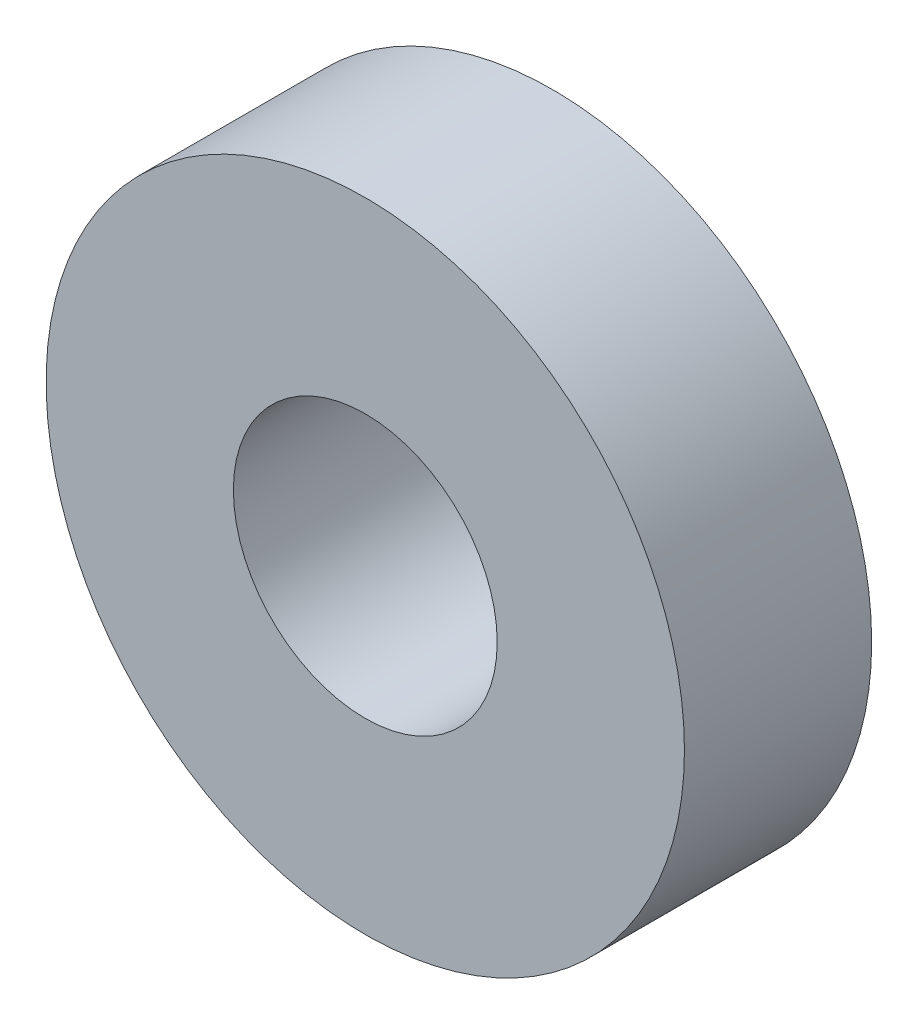
ISO-10303-21;
HEADER;
FILE_DESCRIPTION(('STEP AP214'),'2;1');
FILE_NAME('part.step','',(''),(''),'','','');
FILE_SCHEMA(('AUTOMOTIVE_DESIGN { 1 0 10303 214 1 1 1 1 }'));
ENDSEC;
DATA;
#1=APPLICATION_CONTEXT('core data for automotive mechanical design processes');
#2=APPLICATION_PROTOCOL_DEFINITION('international standard','automotive_design',2000,#1);
#3=PRODUCT_CONTEXT('',#1,'mechanical');
#4=PRODUCT('Part','Part','',(#3));
#5=PRODUCT_RELATED_PRODUCT_CATEGORY('part','',(#4));
#6=PRODUCT_DEFINITION_FORMATION('','',#4);
#7=PRODUCT_DEFINITION_CONTEXT('part definition',#1,'design');
#8=PRODUCT_DEFINITION('design','',#6,#7);
#9=PRODUCT_DEFINITION_SHAPE('','',#8);
#10=(LENGTH_UNIT() NAMED_UNIT(*) SI_UNIT(.MILLI.,.METRE.));
#11=(NAMED_UNIT(*) PLANE_ANGLE_UNIT() SI_UNIT($,.RADIAN.));
#12=(NAMED_UNIT(*) SI_UNIT($,.STERADIAN.) SOLID_ANGLE_UNIT());
#13=UNCERTAINTY_MEASURE_WITH_UNIT(LENGTH_MEASURE(1.E-05),#10,'distance_accuracy_value','');
#14=(GEOMETRIC_REPRESENTATION_CONTEXT(3) GLOBAL_UNCERTAINTY_ASSIGNED_CONTEXT((#13)) GLOBAL_UNIT_ASSIGNED_CONTEXT((#10,
#11,#12)) REPRESENTATION_CONTEXT('',''));
#15=CARTESIAN_POINT('',(0.,0.,0.));
#16=DIRECTION('',(0.,0.,1.));
#17=DIRECTION('',(1.,0.,0.));
#18=AXIS2_PLACEMENT_3D('',#15,#16,#17);
#19=CARTESIAN_POINT('',(0.,0.,-5.588));
#20=DIRECTION('',(0.,0.,1.));
#21=DIRECTION('',(1.,0.,0.));
#22=AXIS2_PLACEMENT_3D('',#19,#20,#21);
#23=CYLINDRICAL_SURFACE('',#22,3.937);
#24=CARTESIAN_POINT('',(0.,0.,0.));
#25=DIRECTION('',(0.,0.,1.));
#26=DIRECTION('',(1.,0.,0.));
#27=AXIS2_PLACEMENT_3D('',#24,#25,#26);
#28=CIRCLE('',#27,3.937);
#29=CARTESIAN_POINT('',(3.937,0.,0.));
#30=VERTEX_POINT('',#29);
#31=EDGE_CURVE('E18',#30,#30,#28,.F.);
#32=ORIENTED_EDGE('',*,*,#31,.F.);
#33=EDGE_LOOP('',(#32));
#34=FACE_BOUND('',#33,.T.);
#35=CARTESIAN_POINT('',(0.,0.,-5.588));
#36=DIRECTION('',(0.,0.,1.));
#37=DIRECTION('',(1.,0.,0.));
#38=AXIS2_PLACEMENT_3D('',#35,#36,#37);
#39=CIRCLE('',#38,3.937);
#40=CARTESIAN_POINT('',(3.937,0.,-5.588));
#41=VERTEX_POINT('',#40);
#42=EDGE_CURVE('E27',#41,#41,#39,.T.);
#43=ORIENTED_EDGE('',*,*,#42,.F.);
#44=EDGE_LOOP('',(#43));
#45=FACE_BOUND('',#44,.T.);
#46=ADVANCED_FACE('F15',(#34,#45),#23,.F.);
#47=CARTESIAN_POINT('',(0.,9.525,0.));
#48=DIRECTION('',(0.,0.,1.));
#49=DIRECTION('',(1.,0.,0.));
#50=AXIS2_PLACEMENT_3D('',#47,#48,#49);
#51=PLANE('',#50);
#52=CARTESIAN_POINT('',(0.,0.,0.));
#53=DIRECTION('',(0.,0.,1.));
#54=DIRECTION('',(1.,0.,0.));
#55=AXIS2_PLACEMENT_3D('',#52,#53,#54);
#56=CIRCLE('',#55,9.525);
#57=CARTESIAN_POINT('',(9.525,0.,0.));
#58=VERTEX_POINT('',#57);
#59=EDGE_CURVE('E22',#58,#58,#56,.F.);
#60=ORIENTED_EDGE('',*,*,#59,.F.);
#61=EDGE_LOOP('',(#60));
#62=FACE_BOUND('',#61,.T.);
#63=ORIENTED_EDGE('',*,*,#31,.T.);
#64=EDGE_LOOP('',(#63));
#65=FACE_BOUND('',#64,.T.);
#66=ADVANCED_FACE('F35',(#62,#65),#51,.T.);
#67=CARTESIAN_POINT('',(0.,3.937,-5.588));
#68=DIRECTION('',(0.,0.,-1.));
#69=DIRECTION('',(-1.,0.,0.));
#70=AXIS2_PLACEMENT_3D('',#67,#68,#69);
#71=PLANE('',#70);
#72=ORIENTED_EDGE('',*,*,#42,.T.);
#73=EDGE_LOOP('',(#72));
#74=FACE_BOUND('',#73,.T.);
#75=CARTESIAN_POINT('',(0.,0.,-5.588));
#76=DIRECTION('',(0.,0.,1.));
#77=DIRECTION('',(1.,0.,0.));
#78=AXIS2_PLACEMENT_3D('',#75,#76,#77);
#79=CIRCLE('',#78,9.525);
#80=CARTESIAN_POINT('',(9.525,0.,-5.588));
#81=VERTEX_POINT('',#80);
#82=EDGE_CURVE('E10',#81,#81,#79,.T.);
#83=ORIENTED_EDGE('',*,*,#82,.F.);
#84=EDGE_LOOP('',(#83));
#85=FACE_BOUND('',#84,.T.);
#86=ADVANCED_FACE('F43',(#74,#85),#71,.T.);
#87=CARTESIAN_POINT('',(0.,0.,-5.588));
#88=DIRECTION('',(0.,0.,1.));
#89=DIRECTION('',(1.,0.,0.));
#90=AXIS2_PLACEMENT_3D('',#87,#88,#89);
#91=CYLINDRICAL_SURFACE('',#90,9.525);
#92=ORIENTED_EDGE('',*,*,#82,.T.);
#93=EDGE_LOOP('',(#92));
#94=FACE_BOUND('',#93,.T.);
#95=ORIENTED_EDGE('',*,*,#59,.T.);
#96=EDGE_LOOP('',(#95));
#97=FACE_BOUND('',#96,.T.);
#98=ADVANCED_FACE('F45',(#94,#97),#91,.T.);
#99=CLOSED_SHELL('',(#46,#66,#86,#98));
#100=MANIFOLD_SOLID_BREP('B1',#99);
#101=ADVANCED_BREP_SHAPE_REPRESENTATION('',(#18,#100),#14);
#102=SHAPE_DEFINITION_REPRESENTATION(#9,#101);
ENDSEC;
END-ISO-10303-21;
